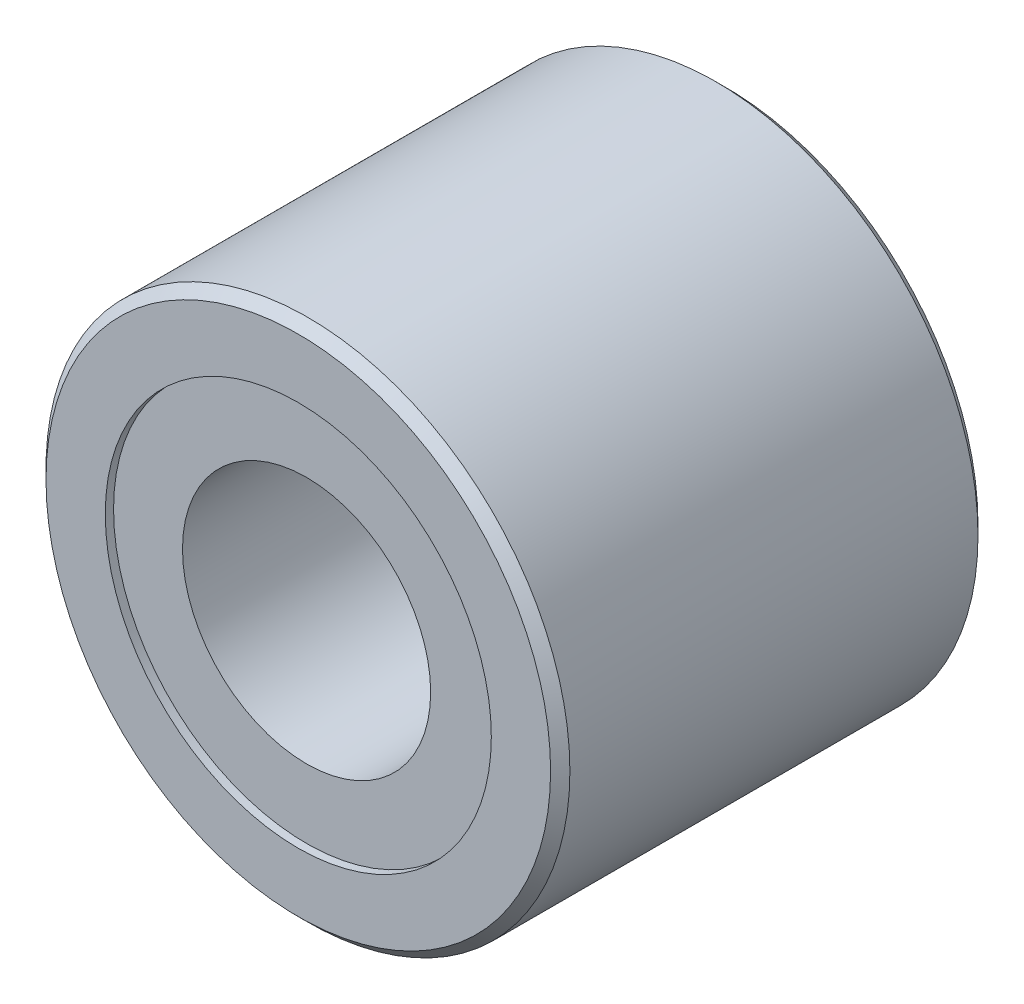
ISO-10303-21;
HEADER;
FILE_DESCRIPTION(('STEP AP214'),'2;1');
FILE_NAME('part.step','',(''),(''),'','','');
FILE_SCHEMA(('AUTOMOTIVE_DESIGN { 1 0 10303 214 1 1 1 1 }'));
ENDSEC;
DATA;
#1=APPLICATION_CONTEXT('core data for automotive mechanical design processes');
#2=APPLICATION_PROTOCOL_DEFINITION('international standard','automotive_design',2000,#1);
#3=PRODUCT_CONTEXT('',#1,'mechanical');
#4=PRODUCT('Part','Part','',(#3));
#5=PRODUCT_RELATED_PRODUCT_CATEGORY('part','',(#4));
#6=PRODUCT_DEFINITION_FORMATION('','',#4);
#7=PRODUCT_DEFINITION_CONTEXT('part definition',#1,'design');
#8=PRODUCT_DEFINITION('design','',#6,#7);
#9=PRODUCT_DEFINITION_SHAPE('','',#8);
#10=(LENGTH_UNIT() NAMED_UNIT(*) SI_UNIT(.MILLI.,.METRE.));
#11=(NAMED_UNIT(*) PLANE_ANGLE_UNIT() SI_UNIT($,.RADIAN.));
#12=(NAMED_UNIT(*) SI_UNIT($,.STERADIAN.) SOLID_ANGLE_UNIT());
#13=UNCERTAINTY_MEASURE_WITH_UNIT(LENGTH_MEASURE(1.E-05),#10,'distance_accuracy_value','');
#14=(GEOMETRIC_REPRESENTATION_CONTEXT(3) GLOBAL_UNCERTAINTY_ASSIGNED_CONTEXT((#13)) GLOBAL_UNIT_ASSIGNED_CONTEXT((#10,
#11,#12)) REPRESENTATION_CONTEXT('',''));
#15=CARTESIAN_POINT('',(0.,0.,0.));
#16=DIRECTION('',(0.,0.,1.));
#17=DIRECTION('',(1.,0.,0.));
#18=AXIS2_PLACEMENT_3D('',#15,#16,#17);
#19=CARTESIAN_POINT('',(0.,0.,15.5));
#20=DIRECTION('',(0.,0.,-1.));
#21=DIRECTION('',(-1.,0.,0.));
#22=AXIS2_PLACEMENT_3D('',#19,#20,#21);
#23=CYLINDRICAL_SURFACE('',#22,7.);
#24=CARTESIAN_POINT('',(0.,0.,15.5));
#25=DIRECTION('',(0.,0.,1.));
#26=DIRECTION('',(1.,0.,0.));
#27=AXIS2_PLACEMENT_3D('',#24,#25,#26);
#28=CIRCLE('',#27,7.);
#29=CARTESIAN_POINT('',(7.,0.,15.5));
#30=VERTEX_POINT('',#29);
#31=EDGE_CURVE('E55',#30,#30,#28,.T.);
#32=ORIENTED_EDGE('',*,*,#31,.T.);
#33=EDGE_LOOP('',(#32));
#34=FACE_BOUND('',#33,.T.);
#35=CARTESIAN_POINT('',(0.,0.,15.2));
#36=DIRECTION('',(0.,0.,-1.));
#37=DIRECTION('',(-1.,0.,0.));
#38=AXIS2_PLACEMENT_3D('',#35,#36,#37);
#39=CIRCLE('',#38,7.);
#40=CARTESIAN_POINT('',(-7.,0.,15.2));
#41=VERTEX_POINT('',#40);
#42=EDGE_CURVE('E59',#41,#41,#39,.T.);
#43=ORIENTED_EDGE('',*,*,#42,.T.);
#44=EDGE_LOOP('',(#43));
#45=FACE_BOUND('',#44,.T.);
#46=ADVANCED_FACE('F32',(#34,#45),#23,.F.);
#47=CARTESIAN_POINT('',(0.,0.,15.5));
#48=DIRECTION('',(0.,0.,1.));
#49=DIRECTION('',(1.,0.,0.));
#50=AXIS2_PLACEMENT_3D('',#47,#48,#49);
#51=PLANE('',#50);
#52=CARTESIAN_POINT('',(0.,0.,15.5));
#53=DIRECTION('',(0.,0.,1.));
#54=DIRECTION('',(1.,0.,0.));
#55=AXIS2_PLACEMENT_3D('',#52,#53,#54);
#56=CIRCLE('',#55,9.15);
#57=CARTESIAN_POINT('',(9.15,0.,15.5));
#58=VERTEX_POINT('',#57);
#59=EDGE_CURVE('E47',#58,#58,#56,.T.);
#60=ORIENTED_EDGE('',*,*,#59,.T.);
#61=EDGE_LOOP('',(#60));
#62=FACE_BOUND('',#61,.T.);
#63=ORIENTED_EDGE('',*,*,#31,.F.);
#64=EDGE_LOOP('',(#63));
#65=FACE_BOUND('',#64,.T.);
#66=ADVANCED_FACE('F96',(#62,#65),#51,.T.);
#67=CARTESIAN_POINT('',(0.,0.,0.));
#68=DIRECTION('',(0.,0.,1.));
#69=DIRECTION('',(1.,0.,0.));
#70=AXIS2_PLACEMENT_3D('',#67,#68,#69);
#71=PLANE('',#70);
#72=CARTESIAN_POINT('',(0.,0.,0.));
#73=DIRECTION('',(0.,0.,1.));
#74=DIRECTION('',(1.,0.,0.));
#75=AXIS2_PLACEMENT_3D('',#72,#73,#74);
#76=CIRCLE('',#75,9.15);
#77=CARTESIAN_POINT('',(9.15,0.,0.));
#78=VERTEX_POINT('',#77);
#79=EDGE_CURVE('E10',#78,#78,#76,.F.);
#80=ORIENTED_EDGE('',*,*,#79,.T.);
#81=EDGE_LOOP('',(#80));
#82=FACE_BOUND('',#81,.T.);
#83=CARTESIAN_POINT('',(0.,0.,0.));
#84=DIRECTION('',(0.,0.,1.));
#85=DIRECTION('',(1.,0.,0.));
#86=AXIS2_PLACEMENT_3D('',#83,#84,#85);
#87=CIRCLE('',#86,7.);
#88=CARTESIAN_POINT('',(7.,0.,0.));
#89=VERTEX_POINT('',#88);
#90=EDGE_CURVE('E56',#89,#89,#87,.T.);
#91=ORIENTED_EDGE('',*,*,#90,.T.);
#92=EDGE_LOOP('',(#91));
#93=FACE_BOUND('',#92,.T.);
#94=ADVANCED_FACE('F94',(#82,#93),#71,.F.);
#95=CARTESIAN_POINT('',(0.,0.,15.5));
#96=DIRECTION('',(0.,0.,-1.));
#97=DIRECTION('',(-1.,0.,0.));
#98=AXIS2_PLACEMENT_3D('',#95,#96,#97);
#99=CYLINDRICAL_SURFACE('',#98,9.5);
#100=CARTESIAN_POINT('',(0.,0.,15.15));
#101=DIRECTION('',(0.,0.,1.));
#102=DIRECTION('',(1.,0.,0.));
#103=AXIS2_PLACEMENT_3D('',#100,#101,#102);
#104=CIRCLE('',#103,9.5);
#105=CARTESIAN_POINT('',(9.5,0.,15.15));
#106=VERTEX_POINT('',#105);
#107=EDGE_CURVE('E39',#106,#106,#104,.F.);
#108=ORIENTED_EDGE('',*,*,#107,.T.);
#109=EDGE_LOOP('',(#108));
#110=FACE_BOUND('',#109,.T.);
#111=CARTESIAN_POINT('',(0.,0.,0.35));
#112=DIRECTION('',(0.,0.,1.));
#113=DIRECTION('',(1.,0.,0.));
#114=AXIS2_PLACEMENT_3D('',#111,#112,#113);
#115=CIRCLE('',#114,9.5);
#116=CARTESIAN_POINT('',(9.5,0.,0.35));
#117=VERTEX_POINT('',#116);
#118=EDGE_CURVE('E43',#117,#117,#115,.T.);
#119=ORIENTED_EDGE('',*,*,#118,.T.);
#120=EDGE_LOOP('',(#119));
#121=FACE_BOUND('',#120,.T.);
#122=ADVANCED_FACE('F90',(#110,#121),#99,.T.);
#123=CARTESIAN_POINT('',(0.,0.,0.3));
#124=DIRECTION('',(0.,0.,-1.));
#125=DIRECTION('',(-1.,0.,0.));
#126=AXIS2_PLACEMENT_3D('',#123,#124,#125);
#127=CIRCLE('',#126,7.);
#128=CARTESIAN_POINT('',(-7.,0.,0.3));
#129=VERTEX_POINT('',#128);
#130=EDGE_CURVE('E52',#129,#129,#127,.T.);
#131=ORIENTED_EDGE('',*,*,#130,.F.);
#132=EDGE_LOOP('',(#131));
#133=FACE_BOUND('',#132,.T.);
#134=ORIENTED_EDGE('',*,*,#90,.F.);
#135=EDGE_LOOP('',(#134));
#136=FACE_BOUND('',#135,.T.);
#137=ADVANCED_FACE('F87',(#133,#136),#23,.F.);
#138=CARTESIAN_POINT('',(0.,0.,15.2));
#139=DIRECTION('',(0.,0.,-1.));
#140=DIRECTION('',(-1.,0.,0.));
#141=AXIS2_PLACEMENT_3D('',#138,#139,#140);
#142=PLANE('',#141);
#143=CARTESIAN_POINT('',(0.,0.,15.2));
#144=DIRECTION('',(0.,0.,-1.));
#145=DIRECTION('',(-1.,0.,0.));
#146=AXIS2_PLACEMENT_3D('',#143,#144,#145);
#147=CIRCLE('',#146,4.5);
#148=CARTESIAN_POINT('',(-4.5,0.,15.2));
#149=VERTEX_POINT('',#148);
#150=EDGE_CURVE('E64',#149,#149,#147,.T.);
#151=ORIENTED_EDGE('',*,*,#150,.T.);
#152=EDGE_LOOP('',(#151));
#153=FACE_BOUND('',#152,.T.);
#154=ORIENTED_EDGE('',*,*,#42,.F.);
#155=EDGE_LOOP('',(#154));
#156=FACE_BOUND('',#155,.T.);
#157=ADVANCED_FACE('F71',(#153,#156),#142,.F.);
#158=CARTESIAN_POINT('',(0.,0.,0.3));
#159=DIRECTION('',(0.,0.,-1.));
#160=DIRECTION('',(-1.,0.,0.));
#161=AXIS2_PLACEMENT_3D('',#158,#159,#160);
#162=PLANE('',#161);
#163=CARTESIAN_POINT('',(0.,0.,0.3));
#164=DIRECTION('',(0.,0.,-1.));
#165=DIRECTION('',(-1.,0.,0.));
#166=AXIS2_PLACEMENT_3D('',#163,#164,#165);
#167=CIRCLE('',#166,4.5);
#168=CARTESIAN_POINT('',(-4.5,0.,0.3));
#169=VERTEX_POINT('',#168);
#170=EDGE_CURVE('E65',#169,#169,#167,.T.);
#171=ORIENTED_EDGE('',*,*,#170,.F.);
#172=EDGE_LOOP('',(#171));
#173=FACE_BOUND('',#172,.T.);
#174=ORIENTED_EDGE('',*,*,#130,.T.);
#175=EDGE_LOOP('',(#174));
#176=FACE_BOUND('',#175,.T.);
#177=ADVANCED_FACE('F78',(#173,#176),#162,.T.);
#178=CARTESIAN_POINT('',(0.,0.,15.2));
#179=DIRECTION('',(0.,0.,-1.));
#180=DIRECTION('',(-1.,0.,0.));
#181=AXIS2_PLACEMENT_3D('',#178,#179,#180);
#182=CYLINDRICAL_SURFACE('',#181,4.5);
#183=ORIENTED_EDGE('',*,*,#150,.F.);
#184=EDGE_LOOP('',(#183));
#185=FACE_BOUND('',#184,.T.);
#186=ORIENTED_EDGE('',*,*,#170,.T.);
#187=EDGE_LOOP('',(#186));
#188=FACE_BOUND('',#187,.T.);
#189=ADVANCED_FACE('F74',(#185,#188),#182,.F.);
#190=CARTESIAN_POINT('',(0.,0.,15.5));
#191=DIRECTION('',(0.,0.,-1.));
#192=DIRECTION('',(-1.,0.,0.));
#193=AXIS2_PLACEMENT_3D('',#190,#191,#192);
#194=CONICAL_SURFACE('',#193,9.15,0.785398163397443);
#195=ORIENTED_EDGE('',*,*,#107,.F.);
#196=EDGE_LOOP('',(#195));
#197=FACE_BOUND('',#196,.T.);
#198=ORIENTED_EDGE('',*,*,#59,.F.);
#199=EDGE_LOOP('',(#198));
#200=FACE_BOUND('',#199,.T.);
#201=ADVANCED_FACE('F77',(#197,#200),#194,.T.);
#202=CARTESIAN_POINT('',(0.,0.,0.35));
#203=DIRECTION('',(0.,0.,1.));
#204=DIRECTION('',(1.,0.,0.));
#205=AXIS2_PLACEMENT_3D('',#202,#203,#204);
#206=CONICAL_SURFACE('',#205,9.5,0.785398163397448);
#207=ORIENTED_EDGE('',*,*,#79,.F.);
#208=EDGE_LOOP('',(#207));
#209=FACE_BOUND('',#208,.T.);
#210=ORIENTED_EDGE('',*,*,#118,.F.);
#211=EDGE_LOOP('',(#210));
#212=FACE_BOUND('',#211,.T.);
#213=ADVANCED_FACE('F34',(#209,#212),#206,.T.);
#214=CLOSED_SHELL('',(#46,#66,#94,#122,#137,#157,#177,#189,#201,#213));
#215=MANIFOLD_SOLID_BREP('B2',#214);
#216=ADVANCED_BREP_SHAPE_REPRESENTATION('',(#18,#215),#14);
#217=SHAPE_DEFINITION_REPRESENTATION(#9,#216);
ENDSEC;
END-ISO-10303-21;
